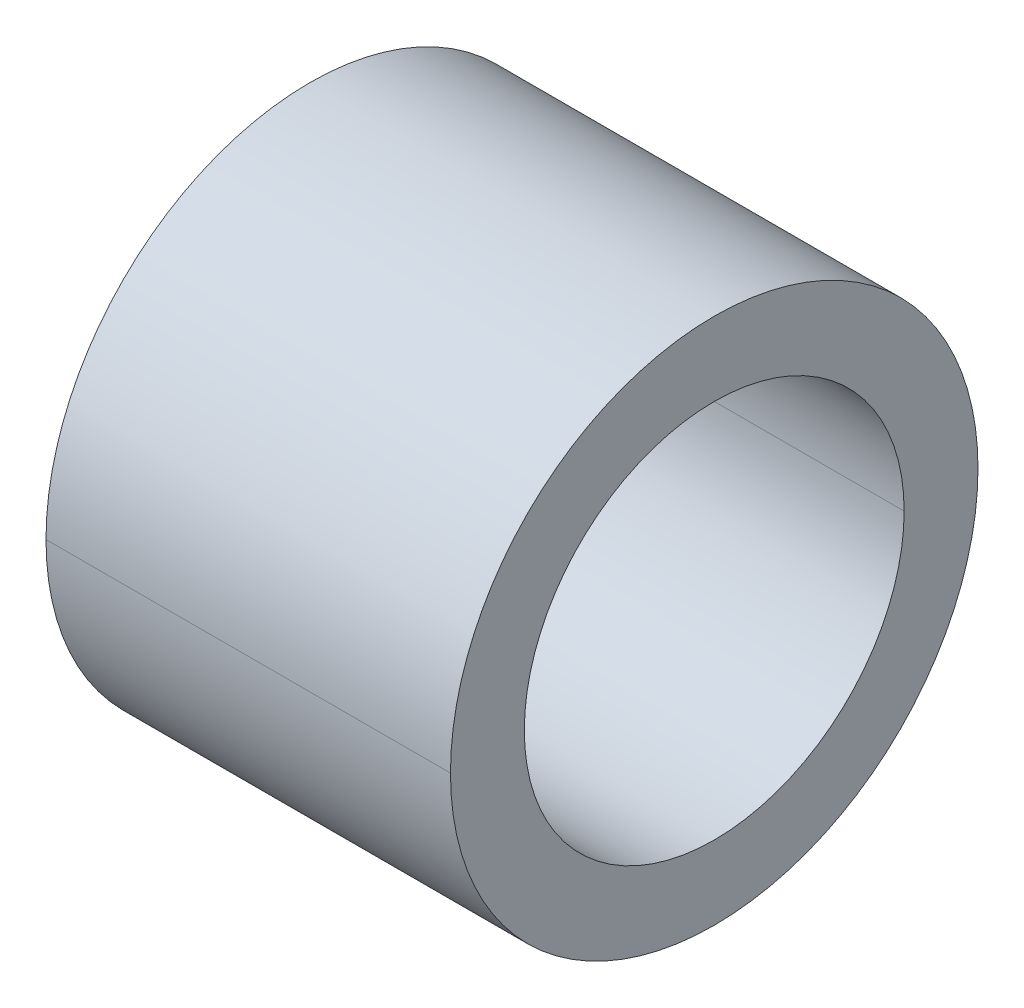
ISO-10303-21;
HEADER;
FILE_DESCRIPTION(('STEP AP214'),'2;1');
FILE_NAME('part.step','',(''),(''),'','','');
FILE_SCHEMA(('AUTOMOTIVE_DESIGN { 1 0 10303 214 1 1 1 1 }'));
ENDSEC;
DATA;
#1=APPLICATION_CONTEXT('core data for automotive mechanical design processes');
#2=APPLICATION_PROTOCOL_DEFINITION('international standard','automotive_design',2000,#1);
#3=PRODUCT_CONTEXT('',#1,'mechanical');
#4=PRODUCT('Part','Part','',(#3));
#5=PRODUCT_RELATED_PRODUCT_CATEGORY('part','',(#4));
#6=PRODUCT_DEFINITION_FORMATION('','',#4);
#7=PRODUCT_DEFINITION_CONTEXT('part definition',#1,'design');
#8=PRODUCT_DEFINITION('design','',#6,#7);
#9=PRODUCT_DEFINITION_SHAPE('','',#8);
#10=(LENGTH_UNIT() NAMED_UNIT(*) SI_UNIT(.MILLI.,.METRE.));
#11=(NAMED_UNIT(*) PLANE_ANGLE_UNIT() SI_UNIT($,.RADIAN.));
#12=(NAMED_UNIT(*) SI_UNIT($,.STERADIAN.) SOLID_ANGLE_UNIT());
#13=UNCERTAINTY_MEASURE_WITH_UNIT(LENGTH_MEASURE(1.E-05),#10,'distance_accuracy_value','');
#14=(GEOMETRIC_REPRESENTATION_CONTEXT(3) GLOBAL_UNCERTAINTY_ASSIGNED_CONTEXT((#13)) GLOBAL_UNIT_ASSIGNED_CONTEXT((#10,
#11,#12)) REPRESENTATION_CONTEXT('',''));
#15=CARTESIAN_POINT('',(0.,0.,0.));
#16=DIRECTION('',(0.,0.,1.));
#17=DIRECTION('',(1.,0.,0.));
#18=AXIS2_PLACEMENT_3D('',#15,#16,#17);
#19=CARTESIAN_POINT('',(88.371512234491,-35.3146706689014,3.32739999999543));
#20=DIRECTION('',(-1.,0.,0.));
#21=DIRECTION('',(0.,0.,1.));
#22=AXIS2_PLACEMENT_3D('',#19,#20,#21);
#23=CYLINDRICAL_SURFACE('',#22,4.1148);
#24=DIRECTION('',(1.,0.,0.));
#25=VECTOR('',#24,1.);
#26=CARTESIAN_POINT('',(83.990012234491,-35.3146706689014,-0.787400000004572));
#27=LINE('',#26,#25);
#28=CARTESIAN_POINT('',(83.990012234491,-35.3146706689014,-0.787400000004572));
#29=VERTEX_POINT('',#28);
#30=CARTESIAN_POINT('',(92.753012234491,-35.3146706689014,-0.787400000004572));
#31=VERTEX_POINT('',#30);
#32=EDGE_CURVE('E20',#29,#31,#27,.T.);
#33=ORIENTED_EDGE('',*,*,#32,.F.);
#34=CARTESIAN_POINT('',(83.990012234491,-35.3146706689014,3.32739999999543));
#35=DIRECTION('',(1.,0.,0.));
#36=DIRECTION('',(0.,0.,1.));
#37=AXIS2_PLACEMENT_3D('',#34,#35,#36);
#38=CIRCLE('',#37,4.1148);
#39=CARTESIAN_POINT('',(83.990012234491,-35.3146706689014,7.44219999999543));
#40=VERTEX_POINT('',#39);
#41=EDGE_CURVE('E31',#40,#29,#38,.T.);
#42=ORIENTED_EDGE('',*,*,#41,.F.);
#43=DIRECTION('',(1.,0.,0.));
#44=VECTOR('',#43,1.);
#45=CARTESIAN_POINT('',(83.990012234491,-35.3146706689014,7.44219999999543));
#46=LINE('',#45,#44);
#47=CARTESIAN_POINT('',(92.753012234491,-35.3146706689014,7.44219999999543));
#48=VERTEX_POINT('',#47);
#49=EDGE_CURVE('E11',#40,#48,#46,.T.);
#50=ORIENTED_EDGE('',*,*,#49,.T.);
#51=CARTESIAN_POINT('',(92.753012234491,-35.3146706689014,3.32739999999543));
#52=DIRECTION('',(-1.,0.,0.));
#53=DIRECTION('',(0.,0.,-1.));
#54=AXIS2_PLACEMENT_3D('',#51,#52,#53);
#55=CIRCLE('',#54,4.1148);
#56=EDGE_CURVE('E62',#31,#48,#55,.T.);
#57=ORIENTED_EDGE('',*,*,#56,.F.);
#58=EDGE_LOOP('',(#33,#42,#50,#57));
#59=FACE_BOUND('',#58,.T.);
#60=ADVANCED_FACE('F17',(#59),#23,.F.);
#61=CARTESIAN_POINT('',(88.371512234491,-35.3146706689014,3.32739999999543));
#62=DIRECTION('',(-1.,0.,0.));
#63=DIRECTION('',(0.,0.,1.));
#64=AXIS2_PLACEMENT_3D('',#61,#62,#63);
#65=CYLINDRICAL_SURFACE('',#64,4.1148);
#66=CARTESIAN_POINT('',(92.753012234491,-35.3146706689014,3.32739999999543));
#67=DIRECTION('',(-1.,0.,0.));
#68=DIRECTION('',(0.,0.,1.));
#69=AXIS2_PLACEMENT_3D('',#66,#67,#68);
#70=CIRCLE('',#69,4.1148);
#71=EDGE_CURVE('E80',#48,#31,#70,.T.);
#72=ORIENTED_EDGE('',*,*,#71,.F.);
#73=ORIENTED_EDGE('',*,*,#49,.F.);
#74=CARTESIAN_POINT('',(83.990012234491,-35.3146706689014,3.32739999999543));
#75=DIRECTION('',(1.,0.,0.));
#76=DIRECTION('',(0.,0.,-1.));
#77=AXIS2_PLACEMENT_3D('',#74,#75,#76);
#78=CIRCLE('',#77,4.1148);
#79=EDGE_CURVE('E61',#29,#40,#78,.T.);
#80=ORIENTED_EDGE('',*,*,#79,.F.);
#81=ORIENTED_EDGE('',*,*,#32,.T.);
#82=EDGE_LOOP('',(#72,#73,#80,#81));
#83=FACE_BOUND('',#82,.T.);
#84=ADVANCED_FACE('F90',(#83),#65,.F.);
#85=CARTESIAN_POINT('',(83.990012234491,-31.1998706689014,3.32739999999543));
#86=DIRECTION('',(-1.,0.,0.));
#87=DIRECTION('',(0.,0.,1.));
#88=AXIS2_PLACEMENT_3D('',#85,#86,#87);
#89=PLANE('',#88);
#90=ORIENTED_EDGE('',*,*,#41,.T.);
#91=ORIENTED_EDGE('',*,*,#79,.T.);
#92=EDGE_LOOP('',(#90,#91));
#93=FACE_BOUND('',#92,.T.);
#94=CARTESIAN_POINT('',(83.990012234491,-35.3146706689014,3.32739999999543));
#95=DIRECTION('',(-1.,0.,0.));
#96=DIRECTION('',(0.,0.,-1.));
#97=AXIS2_PLACEMENT_3D('',#94,#95,#96);
#98=CIRCLE('',#97,5.715);
#99=CARTESIAN_POINT('',(83.990012234491,-35.3146706689014,-2.38760000000457));
#100=VERTEX_POINT('',#99);
#101=CARTESIAN_POINT('',(83.990012234491,-35.3146706689014,9.04239999999543));
#102=VERTEX_POINT('',#101);
#103=EDGE_CURVE('E54',#100,#102,#98,.T.);
#104=ORIENTED_EDGE('',*,*,#103,.T.);
#105=CARTESIAN_POINT('',(83.990012234491,-35.3146706689014,3.32739999999543));
#106=DIRECTION('',(-1.,0.,0.));
#107=DIRECTION('',(0.,0.,1.));
#108=AXIS2_PLACEMENT_3D('',#105,#106,#107);
#109=CIRCLE('',#108,5.715);
#110=EDGE_CURVE('E58',#102,#100,#109,.T.);
#111=ORIENTED_EDGE('',*,*,#110,.T.);
#112=EDGE_LOOP('',(#104,#111));
#113=FACE_BOUND('',#112,.T.);
#114=ADVANCED_FACE('F56',(#93,#113),#89,.T.);
#115=CARTESIAN_POINT('',(88.371512234491,-35.3146706689014,3.32739999999543));
#116=DIRECTION('',(-1.,0.,0.));
#117=DIRECTION('',(0.,0.,1.));
#118=AXIS2_PLACEMENT_3D('',#115,#116,#117);
#119=CYLINDRICAL_SURFACE('',#118,5.715);
#120=CARTESIAN_POINT('',(92.753012234491,-35.3146706689014,3.32739999999543));
#121=DIRECTION('',(1.,0.,0.));
#122=DIRECTION('',(0.,0.,1.));
#123=AXIS2_PLACEMENT_3D('',#120,#121,#122);
#124=CIRCLE('',#123,5.715);
#125=CARTESIAN_POINT('',(92.753012234491,-35.3146706689014,9.04239999999543));
#126=VERTEX_POINT('',#125);
#127=CARTESIAN_POINT('',(92.753012234491,-35.3146706689014,-2.38760000000457));
#128=VERTEX_POINT('',#127);
#129=EDGE_CURVE('E68',#126,#128,#124,.T.);
#130=ORIENTED_EDGE('',*,*,#129,.F.);
#131=DIRECTION('',(1.,0.,0.));
#132=VECTOR('',#131,1.);
#133=CARTESIAN_POINT('',(83.990012234491,-35.3146706689014,9.04239999999543));
#134=LINE('',#133,#132);
#135=EDGE_CURVE('E65',#102,#126,#134,.T.);
#136=ORIENTED_EDGE('',*,*,#135,.F.);
#137=ORIENTED_EDGE('',*,*,#103,.F.);
#138=DIRECTION('',(1.,0.,0.));
#139=VECTOR('',#138,1.);
#140=CARTESIAN_POINT('',(83.990012234491,-35.3146706689014,-2.38760000000457));
#141=LINE('',#140,#139);
#142=EDGE_CURVE('E75',#100,#128,#141,.T.);
#143=ORIENTED_EDGE('',*,*,#142,.T.);
#144=EDGE_LOOP('',(#130,#136,#137,#143));
#145=FACE_BOUND('',#144,.T.);
#146=ADVANCED_FACE('F66',(#145),#119,.T.);
#147=CARTESIAN_POINT('',(92.753012234491,-29.5996706689014,3.32739999999543));
#148=DIRECTION('',(1.,0.,0.));
#149=DIRECTION('',(0.,0.,-1.));
#150=AXIS2_PLACEMENT_3D('',#147,#148,#149);
#151=PLANE('',#150);
#152=ORIENTED_EDGE('',*,*,#56,.T.);
#153=ORIENTED_EDGE('',*,*,#71,.T.);
#154=EDGE_LOOP('',(#152,#153));
#155=FACE_BOUND('',#154,.T.);
#156=ORIENTED_EDGE('',*,*,#129,.T.);
#157=CARTESIAN_POINT('',(92.753012234491,-35.3146706689014,3.32739999999543));
#158=DIRECTION('',(1.,0.,0.));
#159=DIRECTION('',(0.,0.,-1.));
#160=AXIS2_PLACEMENT_3D('',#157,#158,#159);
#161=CIRCLE('',#160,5.715);
#162=EDGE_CURVE('E72',#128,#126,#161,.T.);
#163=ORIENTED_EDGE('',*,*,#162,.T.);
#164=EDGE_LOOP('',(#156,#163));
#165=FACE_BOUND('',#164,.T.);
#166=ADVANCED_FACE('F92',(#155,#165),#151,.T.);
#167=CARTESIAN_POINT('',(88.371512234491,-35.3146706689014,3.32739999999543));
#168=DIRECTION('',(-1.,0.,0.));
#169=DIRECTION('',(0.,0.,1.));
#170=AXIS2_PLACEMENT_3D('',#167,#168,#169);
#171=CYLINDRICAL_SURFACE('',#170,5.715);
#172=ORIENTED_EDGE('',*,*,#142,.F.);
#173=ORIENTED_EDGE('',*,*,#110,.F.);
#174=ORIENTED_EDGE('',*,*,#135,.T.);
#175=ORIENTED_EDGE('',*,*,#162,.F.);
#176=EDGE_LOOP('',(#172,#173,#174,#175));
#177=FACE_BOUND('',#176,.T.);
#178=ADVANCED_FACE('F74',(#177),#171,.T.);
#179=CLOSED_SHELL('',(#60,#84,#114,#146,#166,#178));
#180=MANIFOLD_SOLID_BREP('B1',#179);
#181=ADVANCED_BREP_SHAPE_REPRESENTATION('',(#18,#180),#14);
#182=SHAPE_DEFINITION_REPRESENTATION(#9,#181);
ENDSEC;
END-ISO-10303-21;
